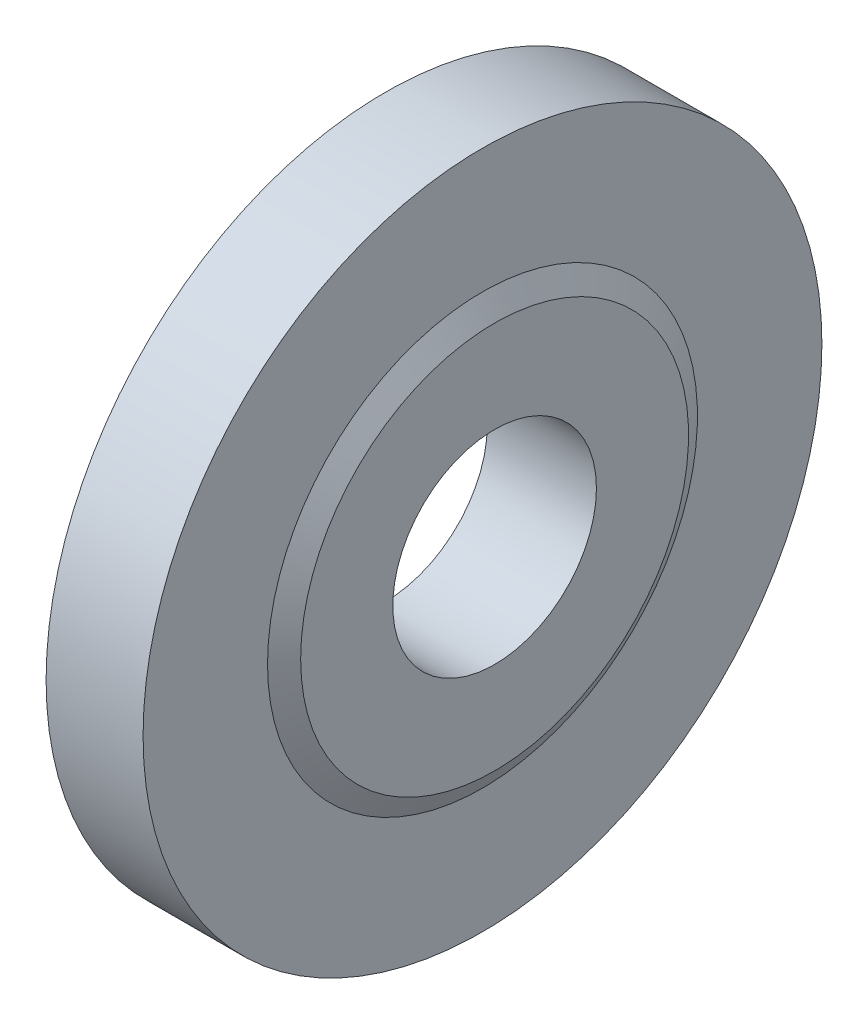
ISO-10303-21;
HEADER;
FILE_DESCRIPTION(('STEP AP214'),'2;1');
FILE_NAME('part.step','',(''),(''),'','','');
FILE_SCHEMA(('AUTOMOTIVE_DESIGN { 1 0 10303 214 1 1 1 1 }'));
ENDSEC;
DATA;
#1=APPLICATION_CONTEXT('core data for automotive mechanical design processes');
#2=APPLICATION_PROTOCOL_DEFINITION('international standard','automotive_design',2000,#1);
#3=PRODUCT_CONTEXT('',#1,'mechanical');
#4=PRODUCT('Part','Part','',(#3));
#5=PRODUCT_RELATED_PRODUCT_CATEGORY('part','',(#4));
#6=PRODUCT_DEFINITION_FORMATION('','',#4);
#7=PRODUCT_DEFINITION_CONTEXT('part definition',#1,'design');
#8=PRODUCT_DEFINITION('design','',#6,#7);
#9=PRODUCT_DEFINITION_SHAPE('','',#8);
#10=(LENGTH_UNIT() NAMED_UNIT(*) SI_UNIT(.MILLI.,.METRE.));
#11=(NAMED_UNIT(*) PLANE_ANGLE_UNIT() SI_UNIT($,.RADIAN.));
#12=(NAMED_UNIT(*) SI_UNIT($,.STERADIAN.) SOLID_ANGLE_UNIT());
#13=UNCERTAINTY_MEASURE_WITH_UNIT(LENGTH_MEASURE(1.E-05),#10,'distance_accuracy_value','');
#14=(GEOMETRIC_REPRESENTATION_CONTEXT(3) GLOBAL_UNCERTAINTY_ASSIGNED_CONTEXT((#13)) GLOBAL_UNIT_ASSIGNED_CONTEXT((#10,
#11,#12)) REPRESENTATION_CONTEXT('',''));
#15=CARTESIAN_POINT('',(0.,0.,0.));
#16=DIRECTION('',(0.,0.,1.));
#17=DIRECTION('',(1.,0.,0.));
#18=AXIS2_PLACEMENT_3D('',#15,#16,#17);
#19=CARTESIAN_POINT('',(0.,0.,0.));
#20=DIRECTION('',(1.,0.,0.));
#21=DIRECTION('',(0.,0.,-1.));
#22=AXIS2_PLACEMENT_3D('',#19,#20,#21);
#23=PLANE('',#22);
#24=CARTESIAN_POINT('',(0.,0.,0.));
#25=DIRECTION('',(1.,0.,0.));
#26=DIRECTION('',(0.,0.,-1.));
#27=AXIS2_PLACEMENT_3D('',#24,#25,#26);
#28=CIRCLE('',#27,4.2);
#29=CARTESIAN_POINT('',(0.,0.,-4.2));
#30=VERTEX_POINT('',#29);
#31=EDGE_CURVE('E63',#30,#30,#28,.T.);
#32=ORIENTED_EDGE('',*,*,#31,.T.);
#33=EDGE_LOOP('',(#32));
#34=FACE_BOUND('',#33,.T.);
#35=CARTESIAN_POINT('',(0.,0.,0.));
#36=DIRECTION('',(-1.,0.,0.));
#37=DIRECTION('',(0.,0.,1.));
#38=AXIS2_PLACEMENT_3D('',#35,#36,#37);
#39=CIRCLE('',#38,14.);
#40=CARTESIAN_POINT('',(0.,0.,14.));
#41=VERTEX_POINT('',#40);
#42=EDGE_CURVE('E10',#41,#41,#39,.T.);
#43=ORIENTED_EDGE('',*,*,#42,.T.);
#44=EDGE_LOOP('',(#43));
#45=FACE_BOUND('',#44,.T.);
#46=ADVANCED_FACE('F38',(#34,#45),#23,.F.);
#47=CARTESIAN_POINT('',(-23.,0.,0.));
#48=DIRECTION('',(-1.,0.,0.));
#49=DIRECTION('',(0.,0.,1.));
#50=AXIS2_PLACEMENT_3D('',#47,#48,#49);
#51=CYLINDRICAL_SURFACE('',#50,14.);
#52=ORIENTED_EDGE('',*,*,#42,.F.);
#53=EDGE_LOOP('',(#52));
#54=FACE_BOUND('',#53,.T.);
#55=CARTESIAN_POINT('',(4.,0.,0.));
#56=DIRECTION('',(-1.,0.,0.));
#57=DIRECTION('',(0.,0.,1.));
#58=AXIS2_PLACEMENT_3D('',#55,#56,#57);
#59=CIRCLE('',#58,14.);
#60=CARTESIAN_POINT('',(4.,0.,14.));
#61=VERTEX_POINT('',#60);
#62=EDGE_CURVE('E45',#61,#61,#59,.T.);
#63=ORIENTED_EDGE('',*,*,#62,.T.);
#64=EDGE_LOOP('',(#63));
#65=FACE_BOUND('',#64,.T.);
#66=ADVANCED_FACE('F89',(#54,#65),#51,.T.);
#67=CARTESIAN_POINT('',(4.,8.86602540378444,0.));
#68=DIRECTION('',(-1.,0.,0.));
#69=DIRECTION('',(0.,0.,1.));
#70=AXIS2_PLACEMENT_3D('',#67,#68,#69);
#71=PLANE('',#70);
#72=ORIENTED_EDGE('',*,*,#62,.F.);
#73=EDGE_LOOP('',(#72));
#74=FACE_BOUND('',#73,.T.);
#75=CARTESIAN_POINT('',(4.,0.,0.));
#76=DIRECTION('',(-1.,0.,0.));
#77=DIRECTION('',(0.,0.,1.));
#78=AXIS2_PLACEMENT_3D('',#75,#76,#77);
#79=CIRCLE('',#78,8.86602540378444);
#80=CARTESIAN_POINT('',(4.,0.,8.86602540378444));
#81=VERTEX_POINT('',#80);
#82=EDGE_CURVE('E51',#81,#81,#79,.T.);
#83=ORIENTED_EDGE('',*,*,#82,.T.);
#84=EDGE_LOOP('',(#83));
#85=FACE_BOUND('',#84,.T.);
#86=ADVANCED_FACE('F83',(#74,#85),#71,.F.);
#87=CARTESIAN_POINT('',(4.5,0.,0.));
#88=DIRECTION('',(-1.,0.,0.));
#89=DIRECTION('',(0.,0.,1.));
#90=AXIS2_PLACEMENT_3D('',#87,#88,#89);
#91=CONICAL_SURFACE('',#90,8.,1.0471975511966);
#92=ORIENTED_EDGE('',*,*,#82,.F.);
#93=EDGE_LOOP('',(#92));
#94=FACE_BOUND('',#93,.T.);
#95=CARTESIAN_POINT('',(4.5,0.,0.));
#96=DIRECTION('',(-1.,0.,0.));
#97=DIRECTION('',(0.,0.,1.));
#98=AXIS2_PLACEMENT_3D('',#95,#96,#97);
#99=CIRCLE('',#98,8.);
#100=CARTESIAN_POINT('',(4.5,0.,8.));
#101=VERTEX_POINT('',#100);
#102=EDGE_CURVE('E57',#101,#101,#99,.T.);
#103=ORIENTED_EDGE('',*,*,#102,.T.);
#104=EDGE_LOOP('',(#103));
#105=FACE_BOUND('',#104,.T.);
#106=ADVANCED_FACE('F78',(#94,#105),#91,.T.);
#107=CARTESIAN_POINT('',(4.5,0.,0.));
#108=DIRECTION('',(-1.,0.,0.));
#109=DIRECTION('',(0.,0.,1.));
#110=AXIS2_PLACEMENT_3D('',#107,#108,#109);
#111=PLANE('',#110);
#112=CARTESIAN_POINT('',(4.5,0.,0.));
#113=DIRECTION('',(1.,0.,0.));
#114=DIRECTION('',(0.,0.,-1.));
#115=AXIS2_PLACEMENT_3D('',#112,#113,#114);
#116=CIRCLE('',#115,4.2);
#117=CARTESIAN_POINT('',(4.5,0.,-4.2));
#118=VERTEX_POINT('',#117);
#119=EDGE_CURVE('E67',#118,#118,#116,.T.);
#120=ORIENTED_EDGE('',*,*,#119,.F.);
#121=EDGE_LOOP('',(#120));
#122=FACE_BOUND('',#121,.T.);
#123=ORIENTED_EDGE('',*,*,#102,.F.);
#124=EDGE_LOOP('',(#123));
#125=FACE_BOUND('',#124,.T.);
#126=ADVANCED_FACE('F75',(#122,#125),#111,.F.);
#127=CARTESIAN_POINT('',(0.,0.,0.));
#128=DIRECTION('',(1.,0.,0.));
#129=DIRECTION('',(0.,0.,-1.));
#130=AXIS2_PLACEMENT_3D('',#127,#128,#129);
#131=CYLINDRICAL_SURFACE('',#130,4.2);
#132=ORIENTED_EDGE('',*,*,#31,.F.);
#133=EDGE_LOOP('',(#132));
#134=FACE_BOUND('',#133,.T.);
#135=ORIENTED_EDGE('',*,*,#119,.T.);
#136=EDGE_LOOP('',(#135));
#137=FACE_BOUND('',#136,.T.);
#138=ADVANCED_FACE('F73',(#134,#137),#131,.F.);
#139=CLOSED_SHELL('',(#46,#66,#86,#106,#126,#138));
#140=MANIFOLD_SOLID_BREP('B2',#139);
#141=ADVANCED_BREP_SHAPE_REPRESENTATION('',(#18,#140),#14);
#142=SHAPE_DEFINITION_REPRESENTATION(#9,#141);
ENDSEC;
END-ISO-10303-21;
